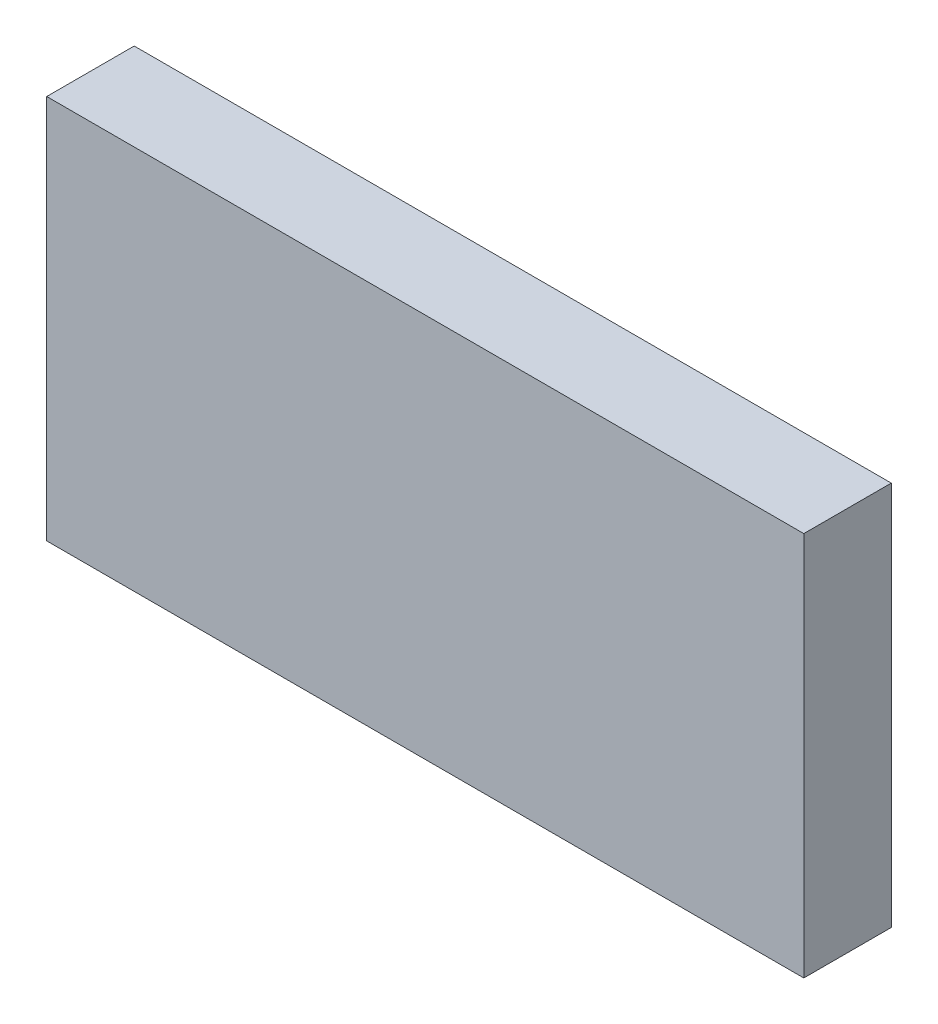
ISO-10303-21;
HEADER;
FILE_DESCRIPTION(('STEP AP214'),'2;1');
FILE_NAME('part.step','',(''),(''),'','','');
FILE_SCHEMA(('AUTOMOTIVE_DESIGN { 1 0 10303 214 1 1 1 1 }'));
ENDSEC;
DATA;
#1=APPLICATION_CONTEXT('core data for automotive mechanical design processes');
#2=APPLICATION_PROTOCOL_DEFINITION('international standard','automotive_design',2000,#1);
#3=PRODUCT_CONTEXT('',#1,'mechanical');
#4=PRODUCT('Part','Part','',(#3));
#5=PRODUCT_RELATED_PRODUCT_CATEGORY('part','',(#4));
#6=PRODUCT_DEFINITION_FORMATION('','',#4);
#7=PRODUCT_DEFINITION_CONTEXT('part definition',#1,'design');
#8=PRODUCT_DEFINITION('design','',#6,#7);
#9=PRODUCT_DEFINITION_SHAPE('','',#8);
#10=(LENGTH_UNIT() NAMED_UNIT(*) SI_UNIT(.MILLI.,.METRE.));
#11=(NAMED_UNIT(*) PLANE_ANGLE_UNIT() SI_UNIT($,.RADIAN.));
#12=(NAMED_UNIT(*) SI_UNIT($,.STERADIAN.) SOLID_ANGLE_UNIT());
#13=UNCERTAINTY_MEASURE_WITH_UNIT(LENGTH_MEASURE(1.E-05),#10,'distance_accuracy_value','');
#14=(GEOMETRIC_REPRESENTATION_CONTEXT(3) GLOBAL_UNCERTAINTY_ASSIGNED_CONTEXT((#13)) GLOBAL_UNIT_ASSIGNED_CONTEXT((#10,
#11,#12)) REPRESENTATION_CONTEXT('',''));
#15=CARTESIAN_POINT('',(0.,0.,0.));
#16=DIRECTION('',(0.,0.,1.));
#17=DIRECTION('',(1.,0.,0.));
#18=AXIS2_PLACEMENT_3D('',#15,#16,#17);
#19=CARTESIAN_POINT('',(0.5795,1.78,0.));
#20=DIRECTION('',(1.,0.,0.));
#21=DIRECTION('',(0.,0.,1.));
#22=AXIS2_PLACEMENT_3D('',#19,#20,#21);
#23=PLANE('',#22);
#24=DIRECTION('',(0.,1.,0.));
#25=VECTOR('',#24,1.);
#26=CARTESIAN_POINT('',(0.5795,1.78,0.1));
#27=LINE('',#26,#25);
#28=CARTESIAN_POINT('',(0.5795,1.78,0.1));
#29=VERTEX_POINT('',#28);
#30=CARTESIAN_POINT('',(0.5795,2.22,0.1));
#31=VERTEX_POINT('',#30);
#32=EDGE_CURVE('E11',#29,#31,#27,.T.);
#33=ORIENTED_EDGE('',*,*,#32,.T.);
#34=DIRECTION('',(0.,0.,1.));
#35=VECTOR('',#34,1.);
#36=CARTESIAN_POINT('',(0.5795,2.22,0.));
#37=LINE('',#36,#35);
#38=CARTESIAN_POINT('',(0.5795,2.22,0.));
#39=VERTEX_POINT('',#38);
#40=EDGE_CURVE('E24',#39,#31,#37,.T.);
#41=ORIENTED_EDGE('',*,*,#40,.F.);
#42=DIRECTION('',(0.,1.,0.));
#43=VECTOR('',#42,1.);
#44=CARTESIAN_POINT('',(0.5795,1.78,0.));
#45=LINE('',#44,#43);
#46=CARTESIAN_POINT('',(0.5795,1.78,0.));
#47=VERTEX_POINT('',#46);
#48=EDGE_CURVE('E86',#47,#39,#45,.T.);
#49=ORIENTED_EDGE('',*,*,#48,.F.);
#50=DIRECTION('',(0.,0.,1.));
#51=VECTOR('',#50,1.);
#52=CARTESIAN_POINT('',(0.5795,1.78,0.));
#53=LINE('',#52,#51);
#54=EDGE_CURVE('E36',#47,#29,#53,.T.);
#55=ORIENTED_EDGE('',*,*,#54,.T.);
#56=EDGE_LOOP('',(#33,#41,#49,#55));
#57=FACE_BOUND('',#56,.T.);
#58=ADVANCED_FACE('F17',(#57),#23,.F.);
#59=CARTESIAN_POINT('',(1.445,1.78,0.));
#60=DIRECTION('',(1.,0.,0.));
#61=DIRECTION('',(0.,0.,1.));
#62=AXIS2_PLACEMENT_3D('',#59,#60,#61);
#63=PLANE('',#62);
#64=DIRECTION('',(0.,0.,1.));
#65=VECTOR('',#64,1.);
#66=CARTESIAN_POINT('',(1.445,1.78,0.));
#67=LINE('',#66,#65);
#68=CARTESIAN_POINT('',(1.445,1.78,0.));
#69=VERTEX_POINT('',#68);
#70=CARTESIAN_POINT('',(1.445,1.78,0.1));
#71=VERTEX_POINT('',#70);
#72=EDGE_CURVE('E83',#69,#71,#67,.T.);
#73=ORIENTED_EDGE('',*,*,#72,.F.);
#74=DIRECTION('',(0.,1.,0.));
#75=VECTOR('',#74,1.);
#76=CARTESIAN_POINT('',(1.445,1.78,0.));
#77=LINE('',#76,#75);
#78=CARTESIAN_POINT('',(1.445,2.22,0.));
#79=VERTEX_POINT('',#78);
#80=EDGE_CURVE('E63',#69,#79,#77,.T.);
#81=ORIENTED_EDGE('',*,*,#80,.T.);
#82=DIRECTION('',(0.,0.,1.));
#83=VECTOR('',#82,1.);
#84=CARTESIAN_POINT('',(1.445,2.22,0.));
#85=LINE('',#84,#83);
#86=CARTESIAN_POINT('',(1.445,2.22,0.1));
#87=VERTEX_POINT('',#86);
#88=EDGE_CURVE('E57',#79,#87,#85,.T.);
#89=ORIENTED_EDGE('',*,*,#88,.T.);
#90=DIRECTION('',(0.,1.,0.));
#91=VECTOR('',#90,1.);
#92=CARTESIAN_POINT('',(1.445,1.78,0.1));
#93=LINE('',#92,#91);
#94=EDGE_CURVE('E60',#71,#87,#93,.T.);
#95=ORIENTED_EDGE('',*,*,#94,.F.);
#96=EDGE_LOOP('',(#73,#81,#89,#95));
#97=FACE_BOUND('',#96,.T.);
#98=ADVANCED_FACE('F59',(#97),#63,.T.);
#99=CARTESIAN_POINT('',(0.5795,1.78,0.));
#100=DIRECTION('',(0.,1.,0.));
#101=DIRECTION('',(0.,0.,1.));
#102=AXIS2_PLACEMENT_3D('',#99,#100,#101);
#103=PLANE('',#102);
#104=ORIENTED_EDGE('',*,*,#72,.T.);
#105=DIRECTION('',(1.,0.,0.));
#106=VECTOR('',#105,1.);
#107=CARTESIAN_POINT('',(0.5795,1.78,0.1));
#108=LINE('',#107,#106);
#109=EDGE_CURVE('E71',#29,#71,#108,.T.);
#110=ORIENTED_EDGE('',*,*,#109,.F.);
#111=ORIENTED_EDGE('',*,*,#54,.F.);
#112=DIRECTION('',(1.,0.,0.));
#113=VECTOR('',#112,1.);
#114=CARTESIAN_POINT('',(0.5795,1.78,0.));
#115=LINE('',#114,#113);
#116=EDGE_CURVE('E76',#47,#69,#115,.T.);
#117=ORIENTED_EDGE('',*,*,#116,.T.);
#118=EDGE_LOOP('',(#104,#110,#111,#117));
#119=FACE_BOUND('',#118,.T.);
#120=ADVANCED_FACE('F91',(#119),#103,.F.);
#121=CARTESIAN_POINT('',(0.5795,2.22,0.));
#122=DIRECTION('',(0.,1.,0.));
#123=DIRECTION('',(0.,0.,1.));
#124=AXIS2_PLACEMENT_3D('',#121,#122,#123);
#125=PLANE('',#124);
#126=DIRECTION('',(1.,0.,0.));
#127=VECTOR('',#126,1.);
#128=CARTESIAN_POINT('',(0.5795,2.22,0.));
#129=LINE('',#128,#127);
#130=EDGE_CURVE('E74',#39,#79,#129,.T.);
#131=ORIENTED_EDGE('',*,*,#130,.F.);
#132=ORIENTED_EDGE('',*,*,#40,.T.);
#133=DIRECTION('',(1.,0.,0.));
#134=VECTOR('',#133,1.);
#135=CARTESIAN_POINT('',(0.5795,2.22,0.1));
#136=LINE('',#135,#134);
#137=EDGE_CURVE('E69',#31,#87,#136,.T.);
#138=ORIENTED_EDGE('',*,*,#137,.T.);
#139=ORIENTED_EDGE('',*,*,#88,.F.);
#140=EDGE_LOOP('',(#131,#132,#138,#139));
#141=FACE_BOUND('',#140,.T.);
#142=ADVANCED_FACE('F73',(#141),#125,.T.);
#143=CARTESIAN_POINT('',(0.5795,1.78,0.));
#144=DIRECTION('',(0.,0.,1.));
#145=DIRECTION('',(1.,0.,0.));
#146=AXIS2_PLACEMENT_3D('',#143,#144,#145);
#147=PLANE('',#146);
#148=ORIENTED_EDGE('',*,*,#130,.T.);
#149=ORIENTED_EDGE('',*,*,#80,.F.);
#150=ORIENTED_EDGE('',*,*,#116,.F.);
#151=ORIENTED_EDGE('',*,*,#48,.T.);
#152=EDGE_LOOP('',(#148,#149,#150,#151));
#153=FACE_BOUND('',#152,.T.);
#154=ADVANCED_FACE('F89',(#153),#147,.F.);
#155=CARTESIAN_POINT('',(0.5795,1.78,0.1));
#156=DIRECTION('',(0.,0.,1.));
#157=DIRECTION('',(1.,0.,0.));
#158=AXIS2_PLACEMENT_3D('',#155,#156,#157);
#159=PLANE('',#158);
#160=ORIENTED_EDGE('',*,*,#32,.F.);
#161=ORIENTED_EDGE('',*,*,#109,.T.);
#162=ORIENTED_EDGE('',*,*,#94,.T.);
#163=ORIENTED_EDGE('',*,*,#137,.F.);
#164=EDGE_LOOP('',(#160,#161,#162,#163));
#165=FACE_BOUND('',#164,.T.);
#166=ADVANCED_FACE('F68',(#165),#159,.T.);
#167=CLOSED_SHELL('',(#58,#98,#120,#142,#154,#166));
#168=MANIFOLD_SOLID_BREP('B1',#167);
#169=ADVANCED_BREP_SHAPE_REPRESENTATION('',(#18,#168),#14);
#170=SHAPE_DEFINITION_REPRESENTATION(#9,#169);
ENDSEC;
END-ISO-10303-21;
